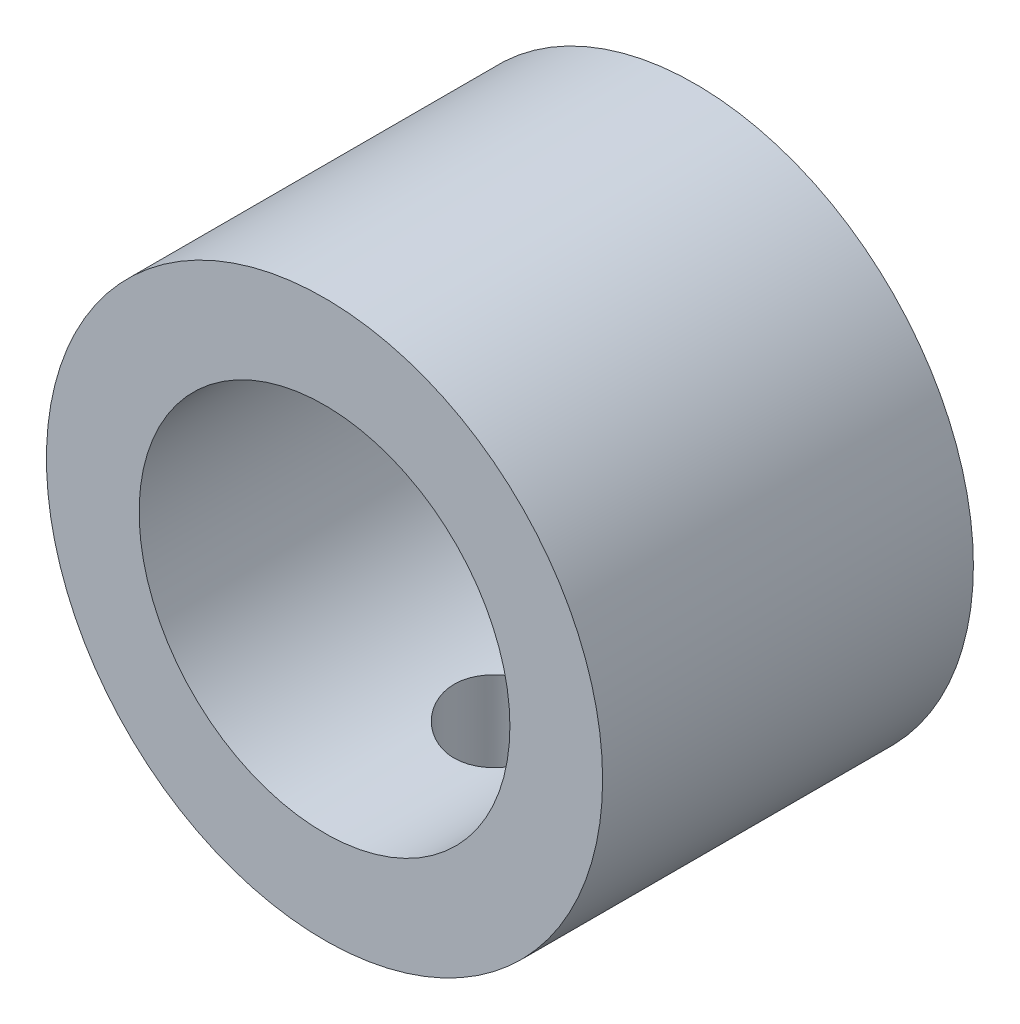
ISO-10303-21;
HEADER;
FILE_DESCRIPTION(('STEP AP214'),'2;1');
FILE_NAME('part.step','',(''),(''),'','','');
FILE_SCHEMA(('AUTOMOTIVE_DESIGN { 1 0 10303 214 1 1 1 1 }'));
ENDSEC;
DATA;
#1=APPLICATION_CONTEXT('core data for automotive mechanical design processes');
#2=APPLICATION_PROTOCOL_DEFINITION('international standard','automotive_design',2000,#1);
#3=PRODUCT_CONTEXT('',#1,'mechanical');
#4=PRODUCT('Part','Part','',(#3));
#5=PRODUCT_RELATED_PRODUCT_CATEGORY('part','',(#4));
#6=PRODUCT_DEFINITION_FORMATION('','',#4);
#7=PRODUCT_DEFINITION_CONTEXT('part definition',#1,'design');
#8=PRODUCT_DEFINITION('design','',#6,#7);
#9=PRODUCT_DEFINITION_SHAPE('','',#8);
#10=(LENGTH_UNIT() NAMED_UNIT(*) SI_UNIT(.MILLI.,.METRE.));
#11=(NAMED_UNIT(*) PLANE_ANGLE_UNIT() SI_UNIT($,.RADIAN.));
#12=(NAMED_UNIT(*) SI_UNIT($,.STERADIAN.) SOLID_ANGLE_UNIT());
#13=UNCERTAINTY_MEASURE_WITH_UNIT(LENGTH_MEASURE(1.E-05),#10,'distance_accuracy_value','');
#14=(GEOMETRIC_REPRESENTATION_CONTEXT(3) GLOBAL_UNCERTAINTY_ASSIGNED_CONTEXT((#13)) GLOBAL_UNIT_ASSIGNED_CONTEXT((#10,
#11,#12)) REPRESENTATION_CONTEXT('',''));
#15=CARTESIAN_POINT('',(0.,0.,0.));
#16=DIRECTION('',(0.,0.,1.));
#17=DIRECTION('',(1.,0.,0.));
#18=AXIS2_PLACEMENT_3D('',#15,#16,#17);
#19=CARTESIAN_POINT('',(0.,0.,5.));
#20=DIRECTION('',(0.,0.,1.));
#21=DIRECTION('',(1.,0.,0.));
#22=AXIS2_PLACEMENT_3D('',#19,#20,#21);
#23=PLANE('',#22);
#24=CARTESIAN_POINT('',(0.,0.,5.));
#25=DIRECTION('',(0.,0.,1.));
#26=DIRECTION('',(1.,0.,0.));
#27=AXIS2_PLACEMENT_3D('',#24,#25,#26);
#28=CIRCLE('',#27,7.5);
#29=CARTESIAN_POINT('',(7.5,0.,5.));
#30=VERTEX_POINT('',#29);
#31=EDGE_CURVE('E10',#30,#30,#28,.T.);
#32=ORIENTED_EDGE('',*,*,#31,.T.);
#33=EDGE_LOOP('',(#32));
#34=FACE_BOUND('',#33,.T.);
#35=CARTESIAN_POINT('',(0.,0.,5.));
#36=DIRECTION('',(0.,0.,1.));
#37=DIRECTION('',(1.,0.,0.));
#38=AXIS2_PLACEMENT_3D('',#35,#36,#37);
#39=CIRCLE('',#38,5.);
#40=CARTESIAN_POINT('',(5.,0.,5.));
#41=VERTEX_POINT('',#40);
#42=EDGE_CURVE('E57',#41,#41,#39,.T.);
#43=ORIENTED_EDGE('',*,*,#42,.F.);
#44=EDGE_LOOP('',(#43));
#45=FACE_BOUND('',#44,.T.);
#46=ADVANCED_FACE('F37',(#34,#45),#23,.T.);
#47=CARTESIAN_POINT('',(0.,0.,-5.));
#48=DIRECTION('',(0.,0.,1.));
#49=DIRECTION('',(1.,0.,0.));
#50=AXIS2_PLACEMENT_3D('',#47,#48,#49);
#51=PLANE('',#50);
#52=CARTESIAN_POINT('',(0.,0.,-5.));
#53=DIRECTION('',(0.,0.,1.));
#54=DIRECTION('',(1.,0.,0.));
#55=AXIS2_PLACEMENT_3D('',#52,#53,#54);
#56=CIRCLE('',#55,7.5);
#57=CARTESIAN_POINT('',(7.5,0.,-5.));
#58=VERTEX_POINT('',#57);
#59=EDGE_CURVE('E51',#58,#58,#56,.T.);
#60=ORIENTED_EDGE('',*,*,#59,.F.);
#61=EDGE_LOOP('',(#60));
#62=FACE_BOUND('',#61,.T.);
#63=CARTESIAN_POINT('',(0.,0.,-5.));
#64=DIRECTION('',(0.,0.,1.));
#65=DIRECTION('',(1.,0.,0.));
#66=AXIS2_PLACEMENT_3D('',#63,#64,#65);
#67=CIRCLE('',#66,5.);
#68=CARTESIAN_POINT('',(5.,0.,-5.));
#69=VERTEX_POINT('',#68);
#70=EDGE_CURVE('E59',#69,#69,#67,.T.);
#71=ORIENTED_EDGE('',*,*,#70,.T.);
#72=EDGE_LOOP('',(#71));
#73=FACE_BOUND('',#72,.T.);
#74=ADVANCED_FACE('F82',(#62,#73),#51,.F.);
#75=CARTESIAN_POINT('',(0.,0.,5.));
#76=DIRECTION('',(0.,0.,-1.));
#77=DIRECTION('',(-1.,0.,0.));
#78=AXIS2_PLACEMENT_3D('',#75,#76,#77);
#79=CYLINDRICAL_SURFACE('',#78,7.5);
#80=CARTESIAN_POINT('',(0.,-7.5,1.5));
#81=CARTESIAN_POINT('',(-0.0833653601889498,-7.49999846371307,1.49999693325248));
#82=CARTESIAN_POINT('',(-0.166769490302284,-7.49859577767346,1.49302673554853));
#83=CARTESIAN_POINT('',(-0.331220261533529,-7.49313548434847,1.46535224982713));
#84=CARTESIAN_POINT('',(-0.412264976312034,-7.48907576790279,1.44463705079774));
#85=CARTESIAN_POINT('',(-0.569595457894969,-7.4787547391743,1.39013808956882));
#86=CARTESIAN_POINT('',(-0.645885701899701,-7.47249553615077,1.35636684473297));
#87=CARTESIAN_POINT('',(-0.791711983296338,-7.45845597052971,1.27675162873306));
#88=CARTESIAN_POINT('',(-0.861248422613718,-7.4506756985356,1.23090837658919));
#89=CARTESIAN_POINT('',(-0.992540215972297,-7.43433247994955,1.12779225856285));
#90=CARTESIAN_POINT('',(-1.05419092673779,-7.42576118256521,1.0703874669132));
#91=CARTESIAN_POINT('',(-1.16705513491204,-7.40886270678882,0.946061375412447));
#92=CARTESIAN_POINT('',(-1.21826781715564,-7.40053554750636,0.879139332997323));
#93=CARTESIAN_POINT('',(-1.30924763002143,-7.38498662718923,0.736925710482187));
#94=CARTESIAN_POINT('',(-1.3489064082988,-7.37777561047419,0.661563534305461));
#95=CARTESIAN_POINT('',(-1.41495849987046,-7.36539402087627,0.505077271493881));
#96=CARTESIAN_POINT('',(-1.44135312365586,-7.36022324642942,0.423953754980482));
#97=CARTESIAN_POINT('',(-1.47978794982724,-7.35259207878307,0.259373454138124));
#98=CARTESIAN_POINT('',(-1.49201174693817,-7.35009705160781,0.175961183786661));
#99=CARTESIAN_POINT('',(-1.50232819158918,-7.34799562590941,0.00823526795348636));
#100=CARTESIAN_POINT('',(-1.50042228407025,-7.34838893201761,-0.0760782844802178));
#101=CARTESIAN_POINT('',(-1.48268185965273,-7.35198826722277,-0.241870182031505));
#102=CARTESIAN_POINT('',(-1.46705781036586,-7.35515179288145,-0.323372108440971));
#103=CARTESIAN_POINT('',(-1.42265682693458,-7.36386819240002,-0.482574114994503));
#104=CARTESIAN_POINT('',(-1.39387926465102,-7.36942118036668,-0.560274013378512));
#105=CARTESIAN_POINT('',(-1.32378717551208,-7.38233427750612,-0.710272892555398));
#106=CARTESIAN_POINT('',(-1.28238922684817,-7.38970634720557,-0.782531819353757));
#107=CARTESIAN_POINT('',(-1.18829036185902,-7.40541928159593,-0.919156274959221));
#108=CARTESIAN_POINT('',(-1.13558814653524,-7.41376025757549,-0.983520895276736));
#109=CARTESIAN_POINT('',(-1.01924990184088,-7.43065531862193,-1.1037441036854));
#110=CARTESIAN_POINT('',(-0.955434241818668,-7.43921053816357,-1.1594288517887));
#111=CARTESIAN_POINT('',(-0.819277536093015,-7.45543273071613,-1.25933076945184));
#112=CARTESIAN_POINT('',(-0.746936381069084,-7.4630996923346,-1.30354779194037));
#113=CARTESIAN_POINT('',(-0.595589080318381,-7.47670035241331,-1.37929126383896));
#114=CARTESIAN_POINT('',(-0.51657272937795,-7.48263133272408,-1.41079784046681));
#115=CARTESIAN_POINT('',(-0.354223464672997,-7.49207113481787,-1.46004071105785));
#116=CARTESIAN_POINT('',(-0.270891075108675,-7.49558025000797,-1.47777867311044));
#117=CARTESIAN_POINT('',(-0.103769108440726,-7.49974007800302,-1.49873468069142));
#118=CARTESIAN_POINT('',(-0.0200104924883644,-7.50043761978705,-1.5021906293104));
#119=CARTESIAN_POINT('',(0.146887401289071,-7.49902577895154,-1.49512521158673));
#120=CARTESIAN_POINT('',(0.23002671366569,-7.49691655412169,-1.48460463097111));
#121=CARTESIAN_POINT('',(0.392558489919811,-7.49015748012026,-1.45008243968407));
#122=CARTESIAN_POINT('',(0.471977922509855,-7.4855306460631,-1.42620289725315));
#123=CARTESIAN_POINT('',(0.625685441249501,-7.47425328091549,-1.36577402601629));
#124=CARTESIAN_POINT('',(0.699973142456309,-7.4676025982134,-1.32922374798476));
#125=CARTESIAN_POINT('',(0.842311760529326,-7.45289867299942,-1.24397626402303));
#126=CARTESIAN_POINT('',(0.910275190128282,-7.44482925655578,-1.19513582844158));
#127=CARTESIAN_POINT('',(1.03712702867881,-7.42822102244824,-1.08688621318908));
#128=CARTESIAN_POINT('',(1.09601446339614,-7.41968215452582,-1.0274759004002));
#129=CARTESIAN_POINT('',(1.20396088616126,-7.40293955335447,-0.898689972163314));
#130=CARTESIAN_POINT('',(1.25285655367298,-7.39474290349956,-0.829176383667994));
#131=CARTESIAN_POINT('',(1.33827813007681,-7.37976287694291,-0.682782957964981));
#132=CARTESIAN_POINT('',(1.37480453388435,-7.37297944370014,-0.605903415639671));
#133=CARTESIAN_POINT('',(1.43422776237294,-7.36165110876574,-0.447347630775677));
#134=CARTESIAN_POINT('',(1.45719524968658,-7.3570946230828,-0.365698738184521));
#135=CARTESIAN_POINT('',(1.48906297744079,-7.35071155188038,-0.199599819763642));
#136=CARTESIAN_POINT('',(1.49796505233767,-7.34888461036667,-0.115150160685979));
#137=CARTESIAN_POINT('',(1.5013813663012,-7.34818724447069,0.0525132968164782));
#138=CARTESIAN_POINT('',(1.49615368210634,-7.34926378783951,0.135721723390514));
#139=CARTESIAN_POINT('',(1.47202845615009,-7.35413360226921,0.30004747485754));
#140=CARTESIAN_POINT('',(1.45313102419395,-7.35792685150754,0.381164816542207));
#141=CARTESIAN_POINT('',(1.40231785274843,-7.36777896328738,0.538841566860818));
#142=CARTESIAN_POINT('',(1.37043376007602,-7.37383231528246,0.615411540753623));
#143=CARTESIAN_POINT('',(1.29458196690241,-7.38752572461255,0.762155581101662));
#144=CARTESIAN_POINT('',(1.25061325316232,-7.39516591498341,0.832329110587706));
#145=CARTESIAN_POINT('',(1.15095887217962,-7.41133440784838,0.965573358225471));
#146=CARTESIAN_POINT('',(1.09508683085277,-7.41987559364549,1.02850314790139));
#147=CARTESIAN_POINT('',(0.973596553519711,-7.43679122807932,1.14417930829376));
#148=CARTESIAN_POINT('',(0.907976080730003,-7.44516563794777,1.19692333547591));
#149=CARTESIAN_POINT('',(0.76802644363237,-7.46090748581957,1.29125196591967));
#150=CARTESIAN_POINT('',(0.693613326644752,-7.46826346828869,1.33271400492004));
#151=CARTESIAN_POINT('',(0.538749541411099,-7.481026876275,1.40247918389489));
#152=CARTESIAN_POINT('',(0.458304391294689,-7.48643605707924,1.43079418429874));
#153=CARTESIAN_POINT('',(0.314732233385669,-7.49364558893056,1.46797792206707));
#154=CARTESIAN_POINT('',(0.252422496020677,-7.49601454737677,1.47996479056164));
#155=CARTESIAN_POINT('',(0.1267492878151,-7.49919231209839,1.49597686853755));
#156=CARTESIAN_POINT('',(0.0633858506229286,-7.50000116809732,1.50000233176465));
#157=CARTESIAN_POINT('',(0.,-7.5,1.5));
#158=B_SPLINE_CURVE_WITH_KNOTS('',3,(#80,#81,#82,#83,#84,#85,#86,#87,#88,#89,#90,#91,#92,#93,
#94,#95,#96,#97,#98,#99,#100,#101,#102,#103,#104,#105,#106,#107,#108,#109,#110,#111,#112,#113,
#114,#115,#116,#117,#118,#119,#120,#121,#122,#123,#124,#125,#126,#127,#128,#129,#130,#131,#132,
#133,#134,#135,#136,#137,#138,#139,#140,#141,#142,#143,#144,#145,#146,#147,#148,#149,#150,#151,
#152,#153,#154,#155,#156,#157),.UNSPECIFIED.,.T.,.F.,(4,2,2,2,2,2,2,2,2,2,2,2,2,2,2,2,2,2,2,2,2,
2,2,2,2,2,2,2,2,2,2,2,2,2,2,2,2,2,4),(0.,0.249864195991888,0.499926976036985,0.749750602875513,
0.999559353346295,1.25239900516828,1.50525839512105,1.76041792508884,2.01555224047796,
2.26734277655381,2.51910756421838,2.76707590509417,3.01505608880594,3.26471235305389,
3.51439732124506,3.76857378737026,4.0227535130973,4.27732912281036,4.53187388547054,
4.78216103514398,5.03243411486801,5.28045680926085,5.52849808824034,5.77957599050038,
6.03068082518895,6.28560942868839,6.540527830852,6.79410571549085,7.04765052495622,
7.29659583851552,7.54553915238913,7.79387941879665,8.042240513728,8.29482114358715,
8.54745981799396,8.80274245013456,9.05779433276278,9.24778162934841,9.43776287056494),.UNSPECIFIED.);
#159=CARTESIAN_POINT('',(0.,-7.5,1.5));
#160=VERTEX_POINT('',#159);
#161=EDGE_CURVE('E66',#160,#160,#158,.T.);
#162=ORIENTED_EDGE('',*,*,#161,.F.);
#163=EDGE_LOOP('',(#162));
#164=FACE_BOUND('',#163,.T.);
#165=ORIENTED_EDGE('',*,*,#31,.F.);
#166=EDGE_LOOP('',(#165));
#167=FACE_BOUND('',#166,.T.);
#168=ORIENTED_EDGE('',*,*,#59,.T.);
#169=EDGE_LOOP('',(#168));
#170=FACE_BOUND('',#169,.T.);
#171=ADVANCED_FACE('F39',(#164,#167,#170),#79,.T.);
#172=CARTESIAN_POINT('',(0.,0.,5.));
#173=DIRECTION('',(0.,0.,-1.));
#174=DIRECTION('',(-1.,0.,0.));
#175=AXIS2_PLACEMENT_3D('',#172,#173,#174);
#176=CYLINDRICAL_SURFACE('',#175,5.);
#177=CARTESIAN_POINT('',(0.,-5.,1.5));
#178=CARTESIAN_POINT('',(0.0822886127532999,-4.9999992925055,1.49999900251511));
#179=CARTESIAN_POINT('',(0.164587318351529,-4.99794915693954,1.49320613637603));
#180=CARTESIAN_POINT('',(0.326788125304881,-4.98997105593691,1.4662786457779));
#181=CARTESIAN_POINT('',(0.40668950441142,-4.98404193389692,1.44614004197666));
#182=CARTESIAN_POINT('',(0.561732707754526,-4.96895552501836,1.39325398308974));
#183=CARTESIAN_POINT('',(0.636881364395373,-4.95980300250425,1.36052513038106));
#184=CARTESIAN_POINT('',(0.780624181053131,-4.93922109237645,1.28346390694416));
#185=CARTESIAN_POINT('',(0.849217467469669,-4.92779140192067,1.23912999260458));
#186=CARTESIAN_POINT('',(0.979871797183745,-4.90350737192774,1.13877599252733));
#187=CARTESIAN_POINT('',(1.04171807124434,-4.89062383657036,1.08248337411409));
#188=CARTESIAN_POINT('',(1.15524920923324,-4.86505834210442,0.960390770089816));
#189=CARTESIAN_POINT('',(1.20693236327441,-4.85237641724501,0.89458918787504));
#190=CARTESIAN_POINT('',(1.29980037723708,-4.82834113993772,0.753529246962389));
#191=CARTESIAN_POINT('',(1.34072309022213,-4.81702406663875,0.678091539009263));
#192=CARTESIAN_POINT('',(1.4092139477476,-4.79743620394031,0.521010745769708));
#193=CARTESIAN_POINT('',(1.43678529919973,-4.78916468313311,0.439369156072025));
#194=CARTESIAN_POINT('',(1.47701633682652,-4.77690870838434,0.27460973386954));
#195=CARTESIAN_POINT('',(1.49007196234677,-4.77281069324533,0.191597256136057));
#196=CARTESIAN_POINT('',(1.50213730614672,-4.76902789749767,0.0244668437832342));
#197=CARTESIAN_POINT('',(1.50115042761078,-4.76934204760571,-0.0596508180590877));
#198=CARTESIAN_POINT('',(1.48546977199812,-4.77424744067778,-0.223383908608484));
#199=CARTESIAN_POINT('',(1.47127205262685,-4.7786838859914,-0.303052250362239));
#200=CARTESIAN_POINT('',(1.43037420427056,-4.79108356228624,-0.45881978627346));
#201=CARTESIAN_POINT('',(1.40367284141641,-4.79904714132351,-0.534918627374333));
#202=CARTESIAN_POINT('',(1.33816026653682,-4.81772733074973,-0.682600349660739));
#203=CARTESIAN_POINT('',(1.29918816934642,-4.82848016115952,-0.754107083955262));
#204=CARTESIAN_POINT('',(1.21035222588683,-4.85150987000065,-0.889732022010192));
#205=CARTESIAN_POINT('',(1.16048574002588,-4.86378711746991,-0.953848429413778));
#206=CARTESIAN_POINT('',(1.04881290765546,-4.88911011297937,-1.07568619076202));
#207=CARTESIAN_POINT('',(0.986594907466972,-4.90216654310498,-1.13302866402967));
#208=CARTESIAN_POINT('',(0.853263259313967,-4.92712244063259,-1.23655398406425));
#209=CARTESIAN_POINT('',(0.782149051860888,-4.9390218351841,-1.28273612841443));
#210=CARTESIAN_POINT('',(0.632355038342803,-4.9604316006947,-1.36285992246473));
#211=CARTESIAN_POINT('',(0.55362774974795,-4.96992543668314,-1.39671751624986));
#212=CARTESIAN_POINT('',(0.391245415603519,-4.98533521832222,-1.45059959009963));
#213=CARTESIAN_POINT('',(0.307591751589581,-4.99125216186999,-1.47062792853249));
#214=CARTESIAN_POINT('',(0.140952242668331,-4.99868364643538,-1.49565217789939));
#215=CARTESIAN_POINT('',(0.0580500976011868,-5.0003485041779,-1.50116158580161));
#216=CARTESIAN_POINT('',(-0.107499605823383,-4.9995292324176,-1.49843084428792));
#217=CARTESIAN_POINT('',(-0.190147196690781,-4.99704565677756,-1.49019253034856));
#218=CARTESIAN_POINT('',(-0.350903605309697,-4.98830696987163,-1.4606153888885));
#219=CARTESIAN_POINT('',(-0.429072772614169,-4.98213829799417,-1.43957661241913));
#220=CARTESIAN_POINT('',(-0.580754638954522,-4.96674347841532,-1.3853567672218));
#221=CARTESIAN_POINT('',(-0.654266777025583,-4.95751696321085,-1.35217423896214));
#222=CARTESIAN_POINT('',(-0.796437189461052,-4.93669654351325,-1.27374683451887));
#223=CARTESIAN_POINT('',(-0.864943826199669,-4.92505280829675,-1.22824065905203));
#224=CARTESIAN_POINT('',(-0.993523307980147,-4.90073468764318,-1.12677524594719));
#225=CARTESIAN_POINT('',(-1.05359403235593,-4.8880600443108,-1.07081338811233));
#226=CARTESIAN_POINT('',(-1.16585744551027,-4.86253171869138,-0.947612691630655));
#227=CARTESIAN_POINT('',(-1.21768481231503,-4.84968825033268,-0.880038124228264));
#228=CARTESIAN_POINT('',(-1.30928995072154,-4.82576515238463,-0.736872060986468));
#229=CARTESIAN_POINT('',(-1.34906803829472,-4.81468547654651,-0.661280775441786));
#230=CARTESIAN_POINT('',(-1.41517347127168,-4.79567189615055,-0.504467508745313));
#231=CARTESIAN_POINT('',(-1.4415634693705,-4.78772337843827,-0.42327381346341));
#232=CARTESIAN_POINT('',(-1.48021730815114,-4.77591594362794,-0.257312031068523));
#233=CARTESIAN_POINT('',(-1.49248598978779,-4.772055625083,-0.172545179212332));
#234=CARTESIAN_POINT('',(-1.50221984485059,-4.76899972496087,-0.00563848162377277));
#235=CARTESIAN_POINT('',(-1.5002805530849,-4.76961647442754,0.0764636510175856));
#236=CARTESIAN_POINT('',(-1.48307505444813,-4.77499401288294,0.2391141033728));
#237=CARTESIAN_POINT('',(-1.46780938124716,-4.77975463592551,0.319662485176353));
#238=CARTESIAN_POINT('',(-1.42476888804136,-4.79275763670385,0.475945399142851));
#239=CARTESIAN_POINT('',(-1.39715175507068,-4.80095604545965,0.551727287361693));
#240=CARTESIAN_POINT('',(-1.33031507121129,-4.81990278909136,0.697642438817723));
#241=CARTESIAN_POINT('',(-1.29109329962876,-4.83065161194312,0.767774617640756));
#242=CARTESIAN_POINT('',(-1.20048763805072,-4.85397676425833,0.903163116527112));
#243=CARTESIAN_POINT('',(-1.14871276092994,-4.86660540163798,0.968148761260411));
#244=CARTESIAN_POINT('',(-1.03517434629782,-4.89201320450026,1.08870249830786));
#245=CARTESIAN_POINT('',(-0.973408217134502,-4.90479240823905,1.14426813946776));
#246=CARTESIAN_POINT('',(-0.839465762183249,-4.92950936570649,1.24602341229503));
#247=CARTESIAN_POINT('',(-0.767037885790608,-4.94141159765674,1.29189144685549));
#248=CARTESIAN_POINT('',(-0.61514137398353,-4.96260680455813,1.37073516990402));
#249=CARTESIAN_POINT('',(-0.535676052998956,-4.97190099931067,1.40371688827451));
#250=CARTESIAN_POINT('',(-0.380757712655282,-4.98602174969301,1.45289527565275));
#251=CARTESIAN_POINT('',(-0.305786961954234,-4.99122027381068,1.47051167288325));
#252=CARTESIAN_POINT('',(-0.15388019523078,-4.99820944494492,1.49406352524158));
#253=CARTESIAN_POINT('',(-0.0769445098581396,-5.0000006615474,1.50000093270482));
#254=CARTESIAN_POINT('',(0.,-5.,1.5));
#255=B_SPLINE_CURVE_WITH_KNOTS('',3,(#177,#178,#179,#180,#181,#182,#183,#184,#185,#186,#187,
#188,#189,#190,#191,#192,#193,#194,#195,#196,#197,#198,#199,#200,#201,#202,#203,#204,#205,#206,
#207,#208,#209,#210,#211,#212,#213,#214,#215,#216,#217,#218,#219,#220,#221,#222,#223,#224,#225,
#226,#227,#228,#229,#230,#231,#232,#233,#234,#235,#236,#237,#238,#239,#240,#241,#242,#243,#244,
#245,#246,#247,#248,#249,#250,#251,#252,#253,#254),.UNSPECIFIED.,.T.,.F.,(4,2,2,2,2,2,2,2,2,2,2,
2,2,2,2,2,2,2,2,2,2,2,2,2,2,2,2,2,2,2,2,2,2,2,2,2,2,2,4),(0.,0.246583203612611,
0.493239964845999,0.739533676300874,0.985860164412701,1.23855602948191,1.49129437288633,
1.74971481004109,2.00807314543224,2.25919689356599,2.51025978319089,2.75226016697676,
2.99428443658001,3.23962426447119,3.48502360158555,3.74067104048166,3.99633456531071,
4.25371046881688,4.51101453528808,4.75908809438545,5.00712853550327,5.24956746682327,
5.49203554593728,5.74011305702908,5.98825282000191,6.24540400322818,6.5025484425268,
6.75847814951252,7.01432009460283,7.25950155466943,7.504673196616,7.74680040402721,
7.98897397553107,8.2399692567993,8.49102974897502,8.7494299615667,9.00770911595235,
9.23831691930459,9.46888616948874),.UNSPECIFIED.);
#256=CARTESIAN_POINT('',(0.,-5.,1.5));
#257=VERTEX_POINT('',#256);
#258=EDGE_CURVE('E41',#257,#257,#255,.T.);
#259=ORIENTED_EDGE('',*,*,#258,.F.);
#260=EDGE_LOOP('',(#259));
#261=FACE_BOUND('',#260,.T.);
#262=ORIENTED_EDGE('',*,*,#42,.T.);
#263=EDGE_LOOP('',(#262));
#264=FACE_BOUND('',#263,.T.);
#265=ORIENTED_EDGE('',*,*,#70,.F.);
#266=EDGE_LOOP('',(#265));
#267=FACE_BOUND('',#266,.T.);
#268=ADVANCED_FACE('F76',(#261,#264,#267),#176,.F.);
#269=CARTESIAN_POINT('',(0.,-7.501,0.));
#270=DIRECTION('',(0.,1.,0.));
#271=DIRECTION('',(0.,0.,1.));
#272=AXIS2_PLACEMENT_3D('',#269,#270,#271);
#273=CYLINDRICAL_SURFACE('',#272,1.5);
#274=ORIENTED_EDGE('',*,*,#258,.T.);
#275=EDGE_LOOP('',(#274));
#276=FACE_BOUND('',#275,.T.);
#277=ORIENTED_EDGE('',*,*,#161,.T.);
#278=EDGE_LOOP('',(#277));
#279=FACE_BOUND('',#278,.T.);
#280=ADVANCED_FACE('F73',(#276,#279),#273,.F.);
#281=CLOSED_SHELL('',(#46,#74,#171,#268,#280));
#282=MANIFOLD_SOLID_BREP('B2',#281);
#283=ADVANCED_BREP_SHAPE_REPRESENTATION('',(#18,#282),#14);
#284=SHAPE_DEFINITION_REPRESENTATION(#9,#283);
ENDSEC;
END-ISO-10303-21;
